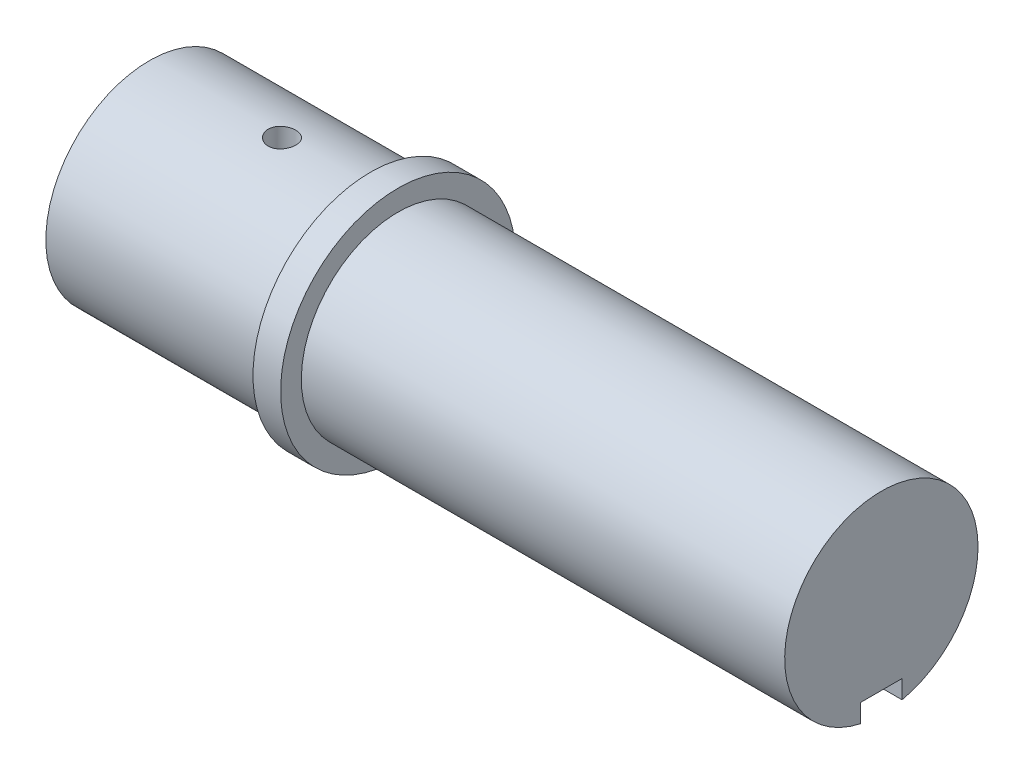
ISO-10303-21;
HEADER;
FILE_DESCRIPTION(('STEP AP214'),'2;1');
FILE_NAME('part.step','',(''),(''),'','','');
FILE_SCHEMA(('AUTOMOTIVE_DESIGN { 1 0 10303 214 1 1 1 1 }'));
ENDSEC;
DATA;
#1=APPLICATION_CONTEXT('core data for automotive mechanical design processes');
#2=APPLICATION_PROTOCOL_DEFINITION('international standard','automotive_design',2000,#1);
#3=PRODUCT_CONTEXT('',#1,'mechanical');
#4=PRODUCT('Part','Part','',(#3));
#5=PRODUCT_RELATED_PRODUCT_CATEGORY('part','',(#4));
#6=PRODUCT_DEFINITION_FORMATION('','',#4);
#7=PRODUCT_DEFINITION_CONTEXT('part definition',#1,'design');
#8=PRODUCT_DEFINITION('design','',#6,#7);
#9=PRODUCT_DEFINITION_SHAPE('','',#8);
#10=(LENGTH_UNIT() NAMED_UNIT(*) SI_UNIT(.MILLI.,.METRE.));
#11=(NAMED_UNIT(*) PLANE_ANGLE_UNIT() SI_UNIT($,.RADIAN.));
#12=(NAMED_UNIT(*) SI_UNIT($,.STERADIAN.) SOLID_ANGLE_UNIT());
#13=UNCERTAINTY_MEASURE_WITH_UNIT(LENGTH_MEASURE(1.E-05),#10,'distance_accuracy_value','');
#14=(GEOMETRIC_REPRESENTATION_CONTEXT(3) GLOBAL_UNCERTAINTY_ASSIGNED_CONTEXT((#13)) GLOBAL_UNIT_ASSIGNED_CONTEXT((#10,
#11,#12)) REPRESENTATION_CONTEXT('',''));
#15=CARTESIAN_POINT('',(0.,0.,0.));
#16=DIRECTION('',(0.,0.,1.));
#17=DIRECTION('',(1.,0.,0.));
#18=AXIS2_PLACEMENT_3D('',#15,#16,#17);
#19=CARTESIAN_POINT('',(16.,0.,0.));
#20=DIRECTION('',(-1.,0.,0.));
#21=DIRECTION('',(0.,0.,1.));
#22=AXIS2_PLACEMENT_3D('',#19,#20,#21);
#23=CYLINDRICAL_SURFACE('',#22,7.5);
#24=CARTESIAN_POINT('',(9.6,7.43303437365925,1.));
#25=CARTESIAN_POINT('',(9.65590192773012,7.43303522266631,0.99999764297421));
#26=CARTESIAN_POINT('',(9.71183801654641,7.43367182371829,0.995296633522847));
#27=CARTESIAN_POINT('',(9.82215123115697,7.43614824351763,0.976618981332773));
#28=CARTESIAN_POINT('',(9.87652670245641,7.43798929330704,0.962632848245785));
#29=CARTESIAN_POINT('',(9.98210568411702,7.44266246058434,0.925806555700512));
#30=CARTESIAN_POINT('',(10.0333114058099,7.4454938777722,0.902972651375006));
#31=CARTESIAN_POINT('',(10.1311555378537,7.45182791129731,0.849112824403648));
#32=CARTESIAN_POINT('',(10.1777946794687,7.45533041990363,0.818088216317403));
#33=CARTESIAN_POINT('',(10.2654867273345,7.46263688659337,0.74851685244753));
#34=CARTESIAN_POINT('',(10.3065064328398,7.4664424424659,0.709928411374282));
#35=CARTESIAN_POINT('',(10.3815081227281,7.47391188129393,0.626414614363068));
#36=CARTESIAN_POINT('',(10.4154897457381,7.47757575696696,0.581488933235996));
#37=CARTESIAN_POINT('',(10.4755709208582,7.48436549880109,0.486365862463803));
#38=CARTESIAN_POINT('',(10.5016402446451,7.48748928251119,0.436149218855612));
#39=CARTESIAN_POINT('',(10.5449630820904,7.49282926707925,0.332001908018687));
#40=CARTESIAN_POINT('',(10.5622169661888,7.49504550607303,0.278071396961202));
#41=CARTESIAN_POINT('',(10.5873194547901,7.49830943097799,0.168367687507046));
#42=CARTESIAN_POINT('',(10.595223407506,7.49936399102537,0.112607361734951));
#43=CARTESIAN_POINT('',(10.6015733043684,7.5002092398576,0.000542501151830005));
#44=CARTESIAN_POINT('',(10.6000196688683,7.49999998481415,-0.0557620093612314));
#45=CARTESIAN_POINT('',(10.5875426347295,7.49834672058453,-0.166940062232883));
#46=CARTESIAN_POINT('',(10.5766787676272,7.49691055668904,-0.221820418680891));
#47=CARTESIAN_POINT('',(10.5459828364892,7.49297362046144,-0.328972061356276));
#48=CARTESIAN_POINT('',(10.5261505824159,7.49047282557017,-0.381243292270918));
#49=CARTESIAN_POINT('',(10.4780182794391,7.48467409502082,-0.481875904212063));
#50=CARTESIAN_POINT('',(10.4496926884085,7.48137376072939,-0.530224924676628));
#51=CARTESIAN_POINT('',(10.3853963713586,7.4743447520952,-0.621505845367391));
#52=CARTESIAN_POINT('',(10.3494252466861,7.47061605542144,-0.664437462933406));
#53=CARTESIAN_POINT('',(10.2705260758205,7.46311294047831,-0.744015030772692));
#54=CARTESIAN_POINT('',(10.2275461159032,7.459338392122,-0.780609516765104));
#55=CARTESIAN_POINT('',(10.1360270343137,7.45219749384619,-0.846073465285954));
#56=CARTESIAN_POINT('',(10.0874878905985,7.44883114554537,-0.874942897181764));
#57=CARTESIAN_POINT('',(9.98617999982665,7.4428878816717,-0.9241414304325));
#58=CARTESIAN_POINT('',(9.93340904774076,7.44031138107393,-0.944466044533532));
#59=CARTESIAN_POINT('',(9.82516098968081,7.43624737732859,-0.975950450224619));
#60=CARTESIAN_POINT('',(9.76968403298672,7.43475981418081,-0.987110746770716));
#61=CARTESIAN_POINT('',(9.65805433249752,7.43305322505173,-0.999880803843634));
#62=CARTESIAN_POINT('',(9.60191003483373,7.43282455755814,-1.00156315549406));
#63=CARTESIAN_POINT('',(9.49014037194763,7.43363612148349,-0.995521440943979));
#64=CARTESIAN_POINT('',(9.43451499413028,7.43467632202375,-0.987797603648882));
#65=CARTESIAN_POINT('',(9.32558200679719,7.43789960218385,-0.963224025185098));
#66=CARTESIAN_POINT('',(9.27226625349095,7.44007823893825,-0.946409751616799));
#67=CARTESIAN_POINT('',(9.16921054327378,7.44532929507204,-0.904169225400626));
#68=CARTESIAN_POINT('',(9.11947072833814,7.44840174991421,-0.878742631046915));
#69=CARTESIAN_POINT('',(9.02465134477959,7.45511723309759,-0.819822032086054));
#70=CARTESIAN_POINT('',(8.97960147581588,7.45876356894567,-0.786280615831502));
#71=CARTESIAN_POINT('',(8.89574453078146,7.46620571758255,-0.712149161563994));
#72=CARTESIAN_POINT('',(8.85693773192599,7.47000153699967,-0.67155881071877));
#73=CARTESIAN_POINT('',(8.78641172303944,7.47734474327666,-0.584163774179119));
#74=CARTESIAN_POINT('',(8.75474034181419,7.48089035024858,-0.537320320466263));
#75=CARTESIAN_POINT('',(8.69971585891234,7.48730670739152,-0.438936226158812));
#76=CARTESIAN_POINT('',(8.67636257012195,7.49017747274246,-0.387395691256851));
#77=CARTESIAN_POINT('',(8.63871536920594,7.49491282345577,-0.281236386261718));
#78=CARTESIAN_POINT('',(8.62439428545822,7.49678042410392,-0.226627392123683));
#79=CARTESIAN_POINT('',(8.60512975726951,7.49931158343309,-0.115753246711601));
#80=CARTESIAN_POINT('',(8.60018582864615,7.49997520428063,-0.0594881810999135));
#81=CARTESIAN_POINT('',(8.59982586637984,7.50002323624209,0.0526349368557925));
#82=CARTESIAN_POINT('',(8.6043362647028,7.49941752456714,0.108492762960938));
#83=CARTESIAN_POINT('',(8.62260052061599,7.4970146660993,0.218648721526175));
#84=CARTESIAN_POINT('',(8.63635436526065,7.49521752097504,0.272946856170522));
#85=CARTESIAN_POINT('',(8.67269102353833,7.49063278321235,0.378429117294428));
#86=CARTESIAN_POINT('',(8.69526981320403,7.48784564204157,0.429614650771954));
#87=CARTESIAN_POINT('',(8.74860777482287,7.48158874697992,0.527482039315436));
#88=CARTESIAN_POINT('',(8.77936709782622,7.47811898048495,0.574163811199581));
#89=CARTESIAN_POINT('',(8.84846334100182,7.47085145604927,0.662073643033367));
#90=CARTESIAN_POINT('',(8.88685489506959,7.46705145149955,0.703258578581997));
#91=CARTESIAN_POINT('',(8.97001153452368,7.45956932448384,0.778629477936078));
#92=CARTESIAN_POINT('',(9.01477812196064,7.45588723005032,0.812813787651154));
#93=CARTESIAN_POINT('',(9.10964197078543,7.4490405494253,0.873343954892477));
#94=CARTESIAN_POINT('',(9.15976179575501,7.44587830880396,0.899654702145639));
#95=CARTESIAN_POINT('',(9.26372423375856,7.4404568329187,0.943447591407441));
#96=CARTESIAN_POINT('',(9.31756278487983,7.43819663011144,0.960939198331793));
#97=CARTESIAN_POINT('',(9.40972413936266,7.43537566912471,0.982477401892938));
#98=CARTESIAN_POINT('',(9.44746913648374,7.4345021431111,0.989038740679089));
#99=CARTESIAN_POINT('',(9.52347075473557,7.43333120737231,0.997800826715829));
#100=CARTESIAN_POINT('',(9.5617273711999,7.43303379239608,1.00000161371131));
#101=CARTESIAN_POINT('',(9.6,7.43303437365925,1.));
#102=B_SPLINE_CURVE_WITH_KNOTS('',3,(#24,#25,#26,#27,#28,#29,#30,#31,#32,#33,#34,#35,#36,#37,
#38,#39,#40,#41,#42,#43,#44,#45,#46,#47,#48,#49,#50,#51,#52,#53,#54,#55,#56,#57,#58,#59,#60,#61,
#62,#63,#64,#65,#66,#67,#68,#69,#70,#71,#72,#73,#74,#75,#76,#77,#78,#79,#80,#81,#82,#83,#84,#85,
#86,#87,#88,#89,#90,#91,#92,#93,#94,#95,#96,#97,#98,#99,#100,#101),.UNSPECIFIED.,.T.,.F.,(4,2,2,
2,2,2,2,2,2,2,2,2,2,2,2,2,2,2,2,2,2,2,2,2,2,2,2,2,2,2,2,2,2,2,2,2,2,2,4),(0.,0.167565944619549,
0.33530342304182,0.502922531373104,0.67051475416376,0.839057975594803,1.00760984880017,
1.17679778261471,1.34597860627362,1.51415284761382,1.68231961431326,1.84941904333874,
2.01652201332237,2.18413264227023,2.35175201291212,2.52067457533377,2.68959780758443,
2.85860963826768,3.02761215573448,3.19531851289862,3.36302078890669,3.53007342408195,
3.69713268808002,3.86519264070064,4.03326005374208,4.2024225588115,4.37158125836474,
4.54022861884065,4.70886727109971,4.87619854927048,5.04352959309218,5.21078442673995,
5.37804234889437,5.54654371183369,5.71508484203598,5.88436670989948,6.05346651155517,
6.16818970471025,6.28291185219902),.UNSPECIFIED.);
#103=CARTESIAN_POINT('',(9.6,7.43303437365925,1.));
#104=VERTEX_POINT('',#103);
#105=EDGE_CURVE('E135',#104,#104,#102,.T.);
#106=ORIENTED_EDGE('',*,*,#105,.F.);
#107=EDGE_LOOP('',(#106));
#108=FACE_BOUND('',#107,.T.);
#109=CARTESIAN_POINT('',(16.,0.,0.));
#110=DIRECTION('',(1.,0.,0.));
#111=DIRECTION('',(0.,0.,-1.));
#112=AXIS2_PLACEMENT_3D('',#109,#110,#111);
#113=CIRCLE('',#112,7.5);
#114=CARTESIAN_POINT('',(16.,0.,-7.5));
#115=VERTEX_POINT('',#114);
#116=EDGE_CURVE('E206',#115,#115,#113,.T.);
#117=ORIENTED_EDGE('',*,*,#116,.F.);
#118=EDGE_LOOP('',(#117));
#119=FACE_BOUND('',#118,.T.);
#120=CARTESIAN_POINT('',(0.,0.,0.));
#121=DIRECTION('',(1.,0.,0.));
#122=DIRECTION('',(0.,0.,-1.));
#123=AXIS2_PLACEMENT_3D('',#120,#121,#122);
#124=CIRCLE('',#123,7.5);
#125=CARTESIAN_POINT('',(0.,0.,-7.5));
#126=VERTEX_POINT('',#125);
#127=EDGE_CURVE('E204',#126,#126,#124,.T.);
#128=ORIENTED_EDGE('',*,*,#127,.T.);
#129=EDGE_LOOP('',(#128));
#130=FACE_BOUND('',#129,.T.);
#131=ADVANCED_FACE('F36',(#108,#119,#130),#23,.T.);
#132=CARTESIAN_POINT('',(0.,0.,0.));
#133=DIRECTION('',(1.,0.,0.));
#134=DIRECTION('',(0.,0.,-1.));
#135=AXIS2_PLACEMENT_3D('',#132,#133,#134);
#136=PLANE('',#135);
#137=DIRECTION('',(0.,0.,-1.));
#138=VECTOR('',#137,1.);
#139=CARTESIAN_POINT('',(0.,4.75,-1.5));
#140=LINE('',#139,#138);
#141=CARTESIAN_POINT('',(0.,4.75,1.5));
#142=VERTEX_POINT('',#141);
#143=CARTESIAN_POINT('',(0.,4.75,-1.5));
#144=VERTEX_POINT('',#143);
#145=EDGE_CURVE('E201',#142,#144,#140,.T.);
#146=ORIENTED_EDGE('',*,*,#145,.F.);
#147=DIRECTION('',(0.,1.,0.));
#148=VECTOR('',#147,1.);
#149=CARTESIAN_POINT('',(0.,3.25,1.5));
#150=LINE('',#149,#148);
#151=CARTESIAN_POINT('',(0.,3.70809924354783,1.5));
#152=VERTEX_POINT('',#151);
#153=EDGE_CURVE('E143',#152,#142,#150,.T.);
#154=ORIENTED_EDGE('',*,*,#153,.F.);
#155=CARTESIAN_POINT('',(0.,0.,0.));
#156=DIRECTION('',(-1.,0.,0.));
#157=DIRECTION('',(0.,0.,1.));
#158=AXIS2_PLACEMENT_3D('',#155,#156,#157);
#159=CIRCLE('',#158,4.);
#160=CARTESIAN_POINT('',(0.,3.70809924354783,-1.5));
#161=VERTEX_POINT('',#160);
#162=EDGE_CURVE('E230',#161,#152,#159,.T.);
#163=ORIENTED_EDGE('',*,*,#162,.F.);
#164=DIRECTION('',(0.,-1.,0.));
#165=VECTOR('',#164,1.);
#166=CARTESIAN_POINT('',(0.,3.25,-1.5));
#167=LINE('',#166,#165);
#168=EDGE_CURVE('E246',#144,#161,#167,.T.);
#169=ORIENTED_EDGE('',*,*,#168,.F.);
#170=EDGE_LOOP('',(#146,#154,#163,#169));
#171=FACE_BOUND('',#170,.T.);
#172=ORIENTED_EDGE('',*,*,#127,.F.);
#173=EDGE_LOOP('',(#172));
#174=FACE_BOUND('',#173,.T.);
#175=ADVANCED_FACE('F188',(#171,#174),#136,.F.);
#176=CARTESIAN_POINT('',(18.,0.,0.));
#177=DIRECTION('',(-1.,0.,0.));
#178=DIRECTION('',(0.,0.,1.));
#179=AXIS2_PLACEMENT_3D('',#176,#177,#178);
#180=CYLINDRICAL_SURFACE('',#179,8.5);
#181=CARTESIAN_POINT('',(18.,0.,0.));
#182=DIRECTION('',(1.,0.,0.));
#183=DIRECTION('',(0.,0.,-1.));
#184=AXIS2_PLACEMENT_3D('',#181,#182,#183);
#185=CIRCLE('',#184,8.5);
#186=CARTESIAN_POINT('',(18.,0.,-8.5));
#187=VERTEX_POINT('',#186);
#188=EDGE_CURVE('E207',#187,#187,#185,.T.);
#189=ORIENTED_EDGE('',*,*,#188,.F.);
#190=EDGE_LOOP('',(#189));
#191=FACE_BOUND('',#190,.T.);
#192=CARTESIAN_POINT('',(16.,0.,0.));
#193=DIRECTION('',(1.,0.,0.));
#194=DIRECTION('',(0.,0.,-1.));
#195=AXIS2_PLACEMENT_3D('',#192,#193,#194);
#196=CIRCLE('',#195,8.5);
#197=CARTESIAN_POINT('',(16.,0.,-8.5));
#198=VERTEX_POINT('',#197);
#199=EDGE_CURVE('E213',#198,#198,#196,.T.);
#200=ORIENTED_EDGE('',*,*,#199,.T.);
#201=EDGE_LOOP('',(#200));
#202=FACE_BOUND('',#201,.T.);
#203=ADVANCED_FACE('F182',(#191,#202),#180,.T.);
#204=CARTESIAN_POINT('',(18.,0.,0.));
#205=DIRECTION('',(1.,0.,0.));
#206=DIRECTION('',(0.,0.,-1.));
#207=AXIS2_PLACEMENT_3D('',#204,#205,#206);
#208=PLANE('',#207);
#209=CARTESIAN_POINT('',(18.,0.,0.));
#210=DIRECTION('',(1.,0.,0.));
#211=DIRECTION('',(0.,0.,-1.));
#212=AXIS2_PLACEMENT_3D('',#209,#210,#211);
#213=CIRCLE('',#212,7.);
#214=CARTESIAN_POINT('',(18.,0.,-7.));
#215=VERTEX_POINT('',#214);
#216=EDGE_CURVE('E210',#215,#215,#213,.T.);
#217=ORIENTED_EDGE('',*,*,#216,.F.);
#218=EDGE_LOOP('',(#217));
#219=FACE_BOUND('',#218,.T.);
#220=ORIENTED_EDGE('',*,*,#188,.T.);
#221=EDGE_LOOP('',(#220));
#222=FACE_BOUND('',#221,.T.);
#223=ADVANCED_FACE('F179',(#219,#222),#208,.T.);
#224=CARTESIAN_POINT('',(16.,0.,0.));
#225=DIRECTION('',(1.,0.,0.));
#226=DIRECTION('',(0.,0.,-1.));
#227=AXIS2_PLACEMENT_3D('',#224,#225,#226);
#228=PLANE('',#227);
#229=ORIENTED_EDGE('',*,*,#116,.T.);
#230=EDGE_LOOP('',(#229));
#231=FACE_BOUND('',#230,.T.);
#232=ORIENTED_EDGE('',*,*,#199,.F.);
#233=EDGE_LOOP('',(#232));
#234=FACE_BOUND('',#233,.T.);
#235=ADVANCED_FACE('F177',(#231,#234),#228,.F.);
#236=CARTESIAN_POINT('',(53.,0.,0.));
#237=DIRECTION('',(-1.,0.,0.));
#238=DIRECTION('',(0.,0.,1.));
#239=AXIS2_PLACEMENT_3D('',#236,#237,#238);
#240=CYLINDRICAL_SURFACE('',#239,7.);
#241=CARTESIAN_POINT('',(53.,0.,0.));
#242=DIRECTION('',(1.,0.,0.));
#243=DIRECTION('',(0.,0.,-1.));
#244=AXIS2_PLACEMENT_3D('',#241,#242,#243);
#245=CIRCLE('',#244,7.);
#246=CARTESIAN_POINT('',(53.,-6.83739716558867,-1.5));
#247=VERTEX_POINT('',#246);
#248=CARTESIAN_POINT('',(53.,-6.83739716558867,1.5));
#249=VERTEX_POINT('',#248);
#250=EDGE_CURVE('E221',#247,#249,#245,.T.);
#251=ORIENTED_EDGE('',*,*,#250,.F.);
#252=DIRECTION('',(-1.,0.,0.));
#253=VECTOR('',#252,1.);
#254=CARTESIAN_POINT('',(53.,-6.83739716558867,-1.5));
#255=LINE('',#254,#253);
#256=CARTESIAN_POINT('',(20.,-6.83739716558867,-1.5));
#257=VERTEX_POINT('',#256);
#258=EDGE_CURVE('E130',#247,#257,#255,.T.);
#259=ORIENTED_EDGE('',*,*,#258,.T.);
#260=CARTESIAN_POINT('',(20.,0.,0.));
#261=DIRECTION('',(-1.,0.,0.));
#262=DIRECTION('',(0.,0.,1.));
#263=AXIS2_PLACEMENT_3D('',#260,#261,#262);
#264=CIRCLE('',#263,7.);
#265=CARTESIAN_POINT('',(20.,-6.83739716558867,1.5));
#266=VERTEX_POINT('',#265);
#267=EDGE_CURVE('E11',#257,#266,#264,.T.);
#268=ORIENTED_EDGE('',*,*,#267,.T.);
#269=DIRECTION('',(-1.,0.,0.));
#270=VECTOR('',#269,1.);
#271=CARTESIAN_POINT('',(53.,-6.83739716558867,1.5));
#272=LINE('',#271,#270);
#273=EDGE_CURVE('E126',#266,#249,#272,.F.);
#274=ORIENTED_EDGE('',*,*,#273,.T.);
#275=EDGE_LOOP('',(#251,#259,#268,#274));
#276=FACE_BOUND('',#275,.T.);
#277=ORIENTED_EDGE('',*,*,#216,.T.);
#278=EDGE_LOOP('',(#277));
#279=FACE_BOUND('',#278,.T.);
#280=ADVANCED_FACE('F173',(#276,#279),#240,.T.);
#281=CARTESIAN_POINT('',(53.,0.,0.));
#282=DIRECTION('',(1.,0.,0.));
#283=DIRECTION('',(0.,0.,-1.));
#284=AXIS2_PLACEMENT_3D('',#281,#282,#283);
#285=PLANE('',#284);
#286=DIRECTION('',(0.,1.,0.));
#287=VECTOR('',#286,1.);
#288=CARTESIAN_POINT('',(53.,0.,-1.5));
#289=LINE('',#288,#287);
#290=CARTESIAN_POINT('',(53.,-5.5,-1.5));
#291=VERTEX_POINT('',#290);
#292=EDGE_CURVE('E43',#247,#291,#289,.T.);
#293=ORIENTED_EDGE('',*,*,#292,.F.);
#294=ORIENTED_EDGE('',*,*,#250,.T.);
#295=DIRECTION('',(0.,-1.,0.));
#296=VECTOR('',#295,1.);
#297=CARTESIAN_POINT('',(53.,-8.5,1.5));
#298=LINE('',#297,#296);
#299=CARTESIAN_POINT('',(53.,-5.5,1.5));
#300=VERTEX_POINT('',#299);
#301=EDGE_CURVE('E110',#300,#249,#298,.T.);
#302=ORIENTED_EDGE('',*,*,#301,.F.);
#303=DIRECTION('',(0.,0.,1.));
#304=VECTOR('',#303,1.);
#305=CARTESIAN_POINT('',(53.,-5.5,1.5));
#306=LINE('',#305,#304);
#307=EDGE_CURVE('E123',#291,#300,#306,.T.);
#308=ORIENTED_EDGE('',*,*,#307,.F.);
#309=EDGE_LOOP('',(#293,#294,#302,#308));
#310=FACE_BOUND('',#309,.T.);
#311=ADVANCED_FACE('F169',(#310),#285,.T.);
#312=CARTESIAN_POINT('',(20.5,0.,0.));
#313=DIRECTION('',(-1.,0.,0.));
#314=DIRECTION('',(0.,0.,1.));
#315=AXIS2_PLACEMENT_3D('',#312,#313,#314);
#316=CYLINDRICAL_SURFACE('',#315,4.);
#317=ORIENTED_EDGE('',*,*,#162,.T.);
#318=DIRECTION('',(-1.,0.,0.));
#319=VECTOR('',#318,1.);
#320=CARTESIAN_POINT('',(20.5,3.70809924354783,1.5));
#321=LINE('',#320,#319);
#322=CARTESIAN_POINT('',(20.5,3.70809924354783,1.5));
#323=VERTEX_POINT('',#322);
#324=EDGE_CURVE('E234',#152,#323,#321,.F.);
#325=ORIENTED_EDGE('',*,*,#324,.T.);
#326=CARTESIAN_POINT('',(20.5,0.,0.));
#327=DIRECTION('',(-1.,0.,0.));
#328=DIRECTION('',(0.,0.,1.));
#329=AXIS2_PLACEMENT_3D('',#326,#327,#328);
#330=CIRCLE('',#329,4.);
#331=CARTESIAN_POINT('',(20.5,3.70809924354783,-1.5));
#332=VERTEX_POINT('',#331);
#333=EDGE_CURVE('E227',#332,#323,#330,.T.);
#334=ORIENTED_EDGE('',*,*,#333,.F.);
#335=DIRECTION('',(-1.,0.,0.));
#336=VECTOR('',#335,1.);
#337=CARTESIAN_POINT('',(20.5,3.70809924354783,-1.5));
#338=LINE('',#337,#336);
#339=EDGE_CURVE('E238',#332,#161,#338,.T.);
#340=ORIENTED_EDGE('',*,*,#339,.T.);
#341=EDGE_LOOP('',(#317,#325,#334,#340));
#342=FACE_BOUND('',#341,.T.);
#343=ADVANCED_FACE('F166',(#342),#316,.F.);
#344=CARTESIAN_POINT('',(20.5,0.,0.));
#345=DIRECTION('',(-1.,0.,0.));
#346=DIRECTION('',(0.,0.,1.));
#347=AXIS2_PLACEMENT_3D('',#344,#345,#346);
#348=PLANE('',#347);
#349=ORIENTED_EDGE('',*,*,#333,.T.);
#350=DIRECTION('',(0.,1.,0.));
#351=VECTOR('',#350,1.);
#352=CARTESIAN_POINT('',(20.5,3.25,1.5));
#353=LINE('',#352,#351);
#354=CARTESIAN_POINT('',(20.5,4.75,1.5));
#355=VERTEX_POINT('',#354);
#356=EDGE_CURVE('E144',#323,#355,#353,.T.);
#357=ORIENTED_EDGE('',*,*,#356,.T.);
#358=DIRECTION('',(0.,0.,-1.));
#359=VECTOR('',#358,1.);
#360=CARTESIAN_POINT('',(20.5,4.75,-1.5));
#361=LINE('',#360,#359);
#362=CARTESIAN_POINT('',(20.5,4.75,-1.5));
#363=VERTEX_POINT('',#362);
#364=EDGE_CURVE('E250',#355,#363,#361,.T.);
#365=ORIENTED_EDGE('',*,*,#364,.T.);
#366=DIRECTION('',(0.,-1.,0.));
#367=VECTOR('',#366,1.);
#368=CARTESIAN_POINT('',(20.5,3.25,-1.5));
#369=LINE('',#368,#367);
#370=EDGE_CURVE('E58',#363,#332,#369,.T.);
#371=ORIENTED_EDGE('',*,*,#370,.T.);
#372=EDGE_LOOP('',(#349,#357,#365,#371));
#373=FACE_BOUND('',#372,.T.);
#374=ADVANCED_FACE('F162',(#373),#348,.T.);
#375=CARTESIAN_POINT('',(20.5,3.25,1.5));
#376=DIRECTION('',(0.,0.,1.));
#377=DIRECTION('',(1.,0.,0.));
#378=AXIS2_PLACEMENT_3D('',#375,#376,#377);
#379=PLANE('',#378);
#380=ORIENTED_EDGE('',*,*,#153,.T.);
#381=DIRECTION('',(-1.,0.,0.));
#382=VECTOR('',#381,1.);
#383=CARTESIAN_POINT('',(20.5,4.75,1.5));
#384=LINE('',#383,#382);
#385=EDGE_CURVE('E242',#355,#142,#384,.T.);
#386=ORIENTED_EDGE('',*,*,#385,.F.);
#387=ORIENTED_EDGE('',*,*,#356,.F.);
#388=ORIENTED_EDGE('',*,*,#324,.F.);
#389=EDGE_LOOP('',(#380,#386,#387,#388));
#390=FACE_BOUND('',#389,.T.);
#391=ADVANCED_FACE('F155',(#390),#379,.F.);
#392=CARTESIAN_POINT('',(20.5,3.25,-1.5));
#393=DIRECTION('',(0.,0.,-1.));
#394=DIRECTION('',(-1.,0.,0.));
#395=AXIS2_PLACEMENT_3D('',#392,#393,#394);
#396=PLANE('',#395);
#397=ORIENTED_EDGE('',*,*,#370,.F.);
#398=DIRECTION('',(-1.,0.,0.));
#399=VECTOR('',#398,1.);
#400=CARTESIAN_POINT('',(20.5,4.75,-1.5));
#401=LINE('',#400,#399);
#402=EDGE_CURVE('E241',#363,#144,#401,.T.);
#403=ORIENTED_EDGE('',*,*,#402,.T.);
#404=ORIENTED_EDGE('',*,*,#168,.T.);
#405=ORIENTED_EDGE('',*,*,#339,.F.);
#406=EDGE_LOOP('',(#397,#403,#404,#405));
#407=FACE_BOUND('',#406,.T.);
#408=ADVANCED_FACE('F151',(#407),#396,.F.);
#409=CARTESIAN_POINT('',(20.5,4.75,-1.5));
#410=DIRECTION('',(0.,1.,0.));
#411=DIRECTION('',(0.,0.,1.));
#412=AXIS2_PLACEMENT_3D('',#409,#410,#411);
#413=PLANE('',#412);
#414=CARTESIAN_POINT('',(9.6,4.75,0.));
#415=DIRECTION('',(0.,1.,0.));
#416=DIRECTION('',(0.,0.,1.));
#417=AXIS2_PLACEMENT_3D('',#414,#415,#416);
#418=CIRCLE('',#417,1.);
#419=CARTESIAN_POINT('',(9.6,4.75,1.));
#420=VERTEX_POINT('',#419);
#421=EDGE_CURVE('E132',#420,#420,#418,.F.);
#422=ORIENTED_EDGE('',*,*,#421,.F.);
#423=EDGE_LOOP('',(#422));
#424=FACE_BOUND('',#423,.T.);
#425=ORIENTED_EDGE('',*,*,#145,.T.);
#426=ORIENTED_EDGE('',*,*,#402,.F.);
#427=ORIENTED_EDGE('',*,*,#364,.F.);
#428=ORIENTED_EDGE('',*,*,#385,.T.);
#429=EDGE_LOOP('',(#425,#426,#427,#428));
#430=FACE_BOUND('',#429,.T.);
#431=ADVANCED_FACE('F154',(#424,#430),#413,.F.);
#432=CARTESIAN_POINT('',(9.6,-8.501,0.));
#433=DIRECTION('',(0.,1.,0.));
#434=DIRECTION('',(0.,0.,1.));
#435=AXIS2_PLACEMENT_3D('',#432,#433,#434);
#436=CYLINDRICAL_SURFACE('',#435,1.);
#437=ORIENTED_EDGE('',*,*,#421,.T.);
#438=EDGE_LOOP('',(#437));
#439=FACE_BOUND('',#438,.T.);
#440=ORIENTED_EDGE('',*,*,#105,.T.);
#441=EDGE_LOOP('',(#440));
#442=FACE_BOUND('',#441,.T.);
#443=ADVANCED_FACE('F146',(#439,#442),#436,.F.);
#444=CARTESIAN_POINT('',(20.,0.,0.));
#445=DIRECTION('',(-1.,0.,0.));
#446=DIRECTION('',(0.,0.,1.));
#447=AXIS2_PLACEMENT_3D('',#444,#445,#446);
#448=PLANE('',#447);
#449=DIRECTION('',(0.,1.,0.));
#450=VECTOR('',#449,1.);
#451=CARTESIAN_POINT('',(20.,-8.5,-1.5));
#452=LINE('',#451,#450);
#453=CARTESIAN_POINT('',(20.,-5.5,-1.5));
#454=VERTEX_POINT('',#453);
#455=EDGE_CURVE('E104',#257,#454,#452,.T.);
#456=ORIENTED_EDGE('',*,*,#455,.T.);
#457=DIRECTION('',(0.,0.,1.));
#458=VECTOR('',#457,1.);
#459=CARTESIAN_POINT('',(20.,-5.5,1.5));
#460=LINE('',#459,#458);
#461=CARTESIAN_POINT('',(20.,-5.5,1.5));
#462=VERTEX_POINT('',#461);
#463=EDGE_CURVE('E107',#454,#462,#460,.T.);
#464=ORIENTED_EDGE('',*,*,#463,.T.);
#465=DIRECTION('',(0.,-1.,0.));
#466=VECTOR('',#465,1.);
#467=CARTESIAN_POINT('',(20.,-8.5,1.5));
#468=LINE('',#467,#466);
#469=EDGE_CURVE('E116',#462,#266,#468,.T.);
#470=ORIENTED_EDGE('',*,*,#469,.T.);
#471=ORIENTED_EDGE('',*,*,#267,.F.);
#472=EDGE_LOOP('',(#456,#464,#470,#471));
#473=FACE_BOUND('',#472,.T.);
#474=ADVANCED_FACE('F105',(#473),#448,.F.);
#475=CARTESIAN_POINT('',(20.,-8.5,-1.5));
#476=DIRECTION('',(0.,0.,-1.));
#477=DIRECTION('',(0.,1.,0.));
#478=AXIS2_PLACEMENT_3D('',#475,#476,#477);
#479=PLANE('',#478);
#480=ORIENTED_EDGE('',*,*,#292,.T.);
#481=DIRECTION('',(1.,0.,0.));
#482=VECTOR('',#481,1.);
#483=CARTESIAN_POINT('',(20.,-5.5,-1.5));
#484=LINE('',#483,#482);
#485=EDGE_CURVE('E50',#454,#291,#484,.T.);
#486=ORIENTED_EDGE('',*,*,#485,.F.);
#487=ORIENTED_EDGE('',*,*,#455,.F.);
#488=ORIENTED_EDGE('',*,*,#258,.F.);
#489=EDGE_LOOP('',(#480,#486,#487,#488));
#490=FACE_BOUND('',#489,.T.);
#491=ADVANCED_FACE('F112',(#490),#479,.F.);
#492=CARTESIAN_POINT('',(20.,-8.5,1.5));
#493=DIRECTION('',(0.,0.,1.));
#494=DIRECTION('',(0.,-1.,0.));
#495=AXIS2_PLACEMENT_3D('',#492,#493,#494);
#496=PLANE('',#495);
#497=ORIENTED_EDGE('',*,*,#469,.F.);
#498=DIRECTION('',(1.,0.,0.));
#499=VECTOR('',#498,1.);
#500=CARTESIAN_POINT('',(20.,-5.5,1.5));
#501=LINE('',#500,#499);
#502=EDGE_CURVE('E115',#462,#300,#501,.T.);
#503=ORIENTED_EDGE('',*,*,#502,.T.);
#504=ORIENTED_EDGE('',*,*,#301,.T.);
#505=ORIENTED_EDGE('',*,*,#273,.F.);
#506=EDGE_LOOP('',(#497,#503,#504,#505));
#507=FACE_BOUND('',#506,.T.);
#508=ADVANCED_FACE('F256',(#507),#496,.F.);
#509=CARTESIAN_POINT('',(20.,-5.5,1.5));
#510=DIRECTION('',(0.,1.,0.));
#511=DIRECTION('',(0.,0.,1.));
#512=AXIS2_PLACEMENT_3D('',#509,#510,#511);
#513=PLANE('',#512);
#514=ORIENTED_EDGE('',*,*,#307,.T.);
#515=ORIENTED_EDGE('',*,*,#502,.F.);
#516=ORIENTED_EDGE('',*,*,#463,.F.);
#517=ORIENTED_EDGE('',*,*,#485,.T.);
#518=EDGE_LOOP('',(#514,#515,#516,#517));
#519=FACE_BOUND('',#518,.T.);
#520=ADVANCED_FACE('F118',(#519),#513,.F.);
#521=CLOSED_SHELL('',(#131,#175,#203,#223,#235,#280,#311,#343,#374,#391,#408,#431,#443,#474,
#491,#508,#520));
#522=MANIFOLD_SOLID_BREP('B2',#521);
#523=ADVANCED_BREP_SHAPE_REPRESENTATION('',(#18,#522),#14);
#524=SHAPE_DEFINITION_REPRESENTATION(#9,#523);
ENDSEC;
END-ISO-10303-21;
